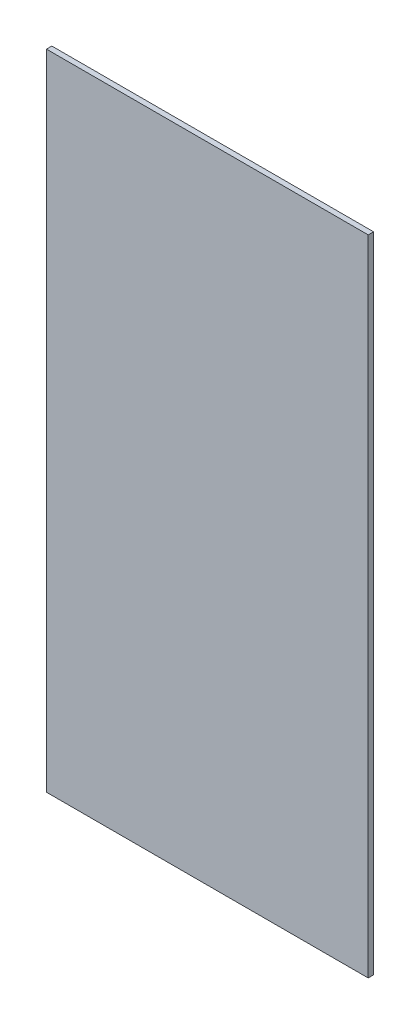
ISO-10303-21;
HEADER;
FILE_DESCRIPTION(('STEP AP214'),'2;1');
FILE_NAME('part.step','',(''),(''),'','','');
FILE_SCHEMA(('AUTOMOTIVE_DESIGN { 1 0 10303 214 1 1 1 1 }'));
ENDSEC;
DATA;
#1=APPLICATION_CONTEXT('core data for automotive mechanical design processes');
#2=APPLICATION_PROTOCOL_DEFINITION('international standard','automotive_design',2000,#1);
#3=PRODUCT_CONTEXT('',#1,'mechanical');
#4=PRODUCT('Part','Part','',(#3));
#5=PRODUCT_RELATED_PRODUCT_CATEGORY('part','',(#4));
#6=PRODUCT_DEFINITION_FORMATION('','',#4);
#7=PRODUCT_DEFINITION_CONTEXT('part definition',#1,'design');
#8=PRODUCT_DEFINITION('design','',#6,#7);
#9=PRODUCT_DEFINITION_SHAPE('','',#8);
#10=(LENGTH_UNIT() NAMED_UNIT(*) SI_UNIT(.MILLI.,.METRE.));
#11=(NAMED_UNIT(*) PLANE_ANGLE_UNIT() SI_UNIT($,.RADIAN.));
#12=(NAMED_UNIT(*) SI_UNIT($,.STERADIAN.) SOLID_ANGLE_UNIT());
#13=UNCERTAINTY_MEASURE_WITH_UNIT(LENGTH_MEASURE(1.E-05),#10,'distance_accuracy_value','');
#14=(GEOMETRIC_REPRESENTATION_CONTEXT(3) GLOBAL_UNCERTAINTY_ASSIGNED_CONTEXT((#13)) GLOBAL_UNIT_ASSIGNED_CONTEXT((#10,
#11,#12)) REPRESENTATION_CONTEXT('',''));
#15=CARTESIAN_POINT('',(0.,0.,0.));
#16=DIRECTION('',(0.,0.,1.));
#17=DIRECTION('',(1.,0.,0.));
#18=AXIS2_PLACEMENT_3D('',#15,#16,#17);
#19=CARTESIAN_POINT('',(-76.2,152.4,1.27));
#20=DIRECTION('',(1.,0.,0.));
#21=DIRECTION('',(0.,0.,-1.));
#22=AXIS2_PLACEMENT_3D('',#19,#20,#21);
#23=PLANE('',#22);
#24=DIRECTION('',(0.,-1.,0.));
#25=VECTOR('',#24,1.);
#26=CARTESIAN_POINT('',(-76.2,152.4,-1.27));
#27=LINE('',#26,#25);
#28=CARTESIAN_POINT('',(-76.2,152.4,-1.27));
#29=VERTEX_POINT('',#28);
#30=CARTESIAN_POINT('',(-76.2,-152.4,-1.27));
#31=VERTEX_POINT('',#30);
#32=EDGE_CURVE('E95',#29,#31,#27,.T.);
#33=ORIENTED_EDGE('',*,*,#32,.T.);
#34=DIRECTION('',(0.,0.,-1.));
#35=VECTOR('',#34,1.);
#36=CARTESIAN_POINT('',(-76.2,-152.4,1.27));
#37=LINE('',#36,#35);
#38=CARTESIAN_POINT('',(-76.2,-152.4,1.27));
#39=VERTEX_POINT('',#38);
#40=EDGE_CURVE('E11',#39,#31,#37,.T.);
#41=ORIENTED_EDGE('',*,*,#40,.F.);
#42=DIRECTION('',(0.,-1.,0.));
#43=VECTOR('',#42,1.);
#44=CARTESIAN_POINT('',(-76.2,152.4,1.27));
#45=LINE('',#44,#43);
#46=CARTESIAN_POINT('',(-76.2,152.4,1.27));
#47=VERTEX_POINT('',#46);
#48=EDGE_CURVE('E83',#47,#39,#45,.T.);
#49=ORIENTED_EDGE('',*,*,#48,.F.);
#50=DIRECTION('',(0.,0.,-1.));
#51=VECTOR('',#50,1.);
#52=CARTESIAN_POINT('',(-76.2,152.4,1.27));
#53=LINE('',#52,#51);
#54=EDGE_CURVE('E91',#47,#29,#53,.T.);
#55=ORIENTED_EDGE('',*,*,#54,.T.);
#56=EDGE_LOOP('',(#33,#41,#49,#55));
#57=FACE_BOUND('',#56,.T.);
#58=ADVANCED_FACE('F32',(#57),#23,.F.);
#59=CARTESIAN_POINT('',(-76.2,-152.4,1.27));
#60=DIRECTION('',(0.,1.,0.));
#61=DIRECTION('',(0.,0.,1.));
#62=AXIS2_PLACEMENT_3D('',#59,#60,#61);
#63=PLANE('',#62);
#64=DIRECTION('',(1.,0.,0.));
#65=VECTOR('',#64,1.);
#66=CARTESIAN_POINT('',(-76.2,-152.4,-1.27));
#67=LINE('',#66,#65);
#68=CARTESIAN_POINT('',(76.2,-152.4,-1.27));
#69=VERTEX_POINT('',#68);
#70=EDGE_CURVE('E87',#31,#69,#67,.T.);
#71=ORIENTED_EDGE('',*,*,#70,.T.);
#72=DIRECTION('',(0.,0.,-1.));
#73=VECTOR('',#72,1.);
#74=CARTESIAN_POINT('',(76.2,-152.4,1.27));
#75=LINE('',#74,#73);
#76=CARTESIAN_POINT('',(76.2,-152.4,1.27));
#77=VERTEX_POINT('',#76);
#78=EDGE_CURVE('E40',#77,#69,#75,.T.);
#79=ORIENTED_EDGE('',*,*,#78,.F.);
#80=DIRECTION('',(1.,0.,0.));
#81=VECTOR('',#80,1.);
#82=CARTESIAN_POINT('',(-76.2,-152.4,1.27));
#83=LINE('',#82,#81);
#84=EDGE_CURVE('E78',#39,#77,#83,.T.);
#85=ORIENTED_EDGE('',*,*,#84,.F.);
#86=ORIENTED_EDGE('',*,*,#40,.T.);
#87=EDGE_LOOP('',(#71,#79,#85,#86));
#88=FACE_BOUND('',#87,.T.);
#89=ADVANCED_FACE('F86',(#88),#63,.F.);
#90=CARTESIAN_POINT('',(76.2,152.4,1.27));
#91=DIRECTION('',(-1.,0.,0.));
#92=DIRECTION('',(0.,0.,1.));
#93=AXIS2_PLACEMENT_3D('',#90,#91,#92);
#94=PLANE('',#93);
#95=DIRECTION('',(0.,1.,0.));
#96=VECTOR('',#95,1.);
#97=CARTESIAN_POINT('',(76.2,152.4,-1.27));
#98=LINE('',#97,#96);
#99=CARTESIAN_POINT('',(76.2,152.4,-1.27));
#100=VERTEX_POINT('',#99);
#101=EDGE_CURVE('E65',#69,#100,#98,.T.);
#102=ORIENTED_EDGE('',*,*,#101,.T.);
#103=DIRECTION('',(0.,0.,-1.));
#104=VECTOR('',#103,1.);
#105=CARTESIAN_POINT('',(76.2,152.4,1.27));
#106=LINE('',#105,#104);
#107=CARTESIAN_POINT('',(76.2,152.4,1.27));
#108=VERTEX_POINT('',#107);
#109=EDGE_CURVE('E88',#108,#100,#106,.T.);
#110=ORIENTED_EDGE('',*,*,#109,.F.);
#111=DIRECTION('',(0.,1.,0.));
#112=VECTOR('',#111,1.);
#113=CARTESIAN_POINT('',(76.2,152.4,1.27));
#114=LINE('',#113,#112);
#115=EDGE_CURVE('E81',#77,#108,#114,.T.);
#116=ORIENTED_EDGE('',*,*,#115,.F.);
#117=ORIENTED_EDGE('',*,*,#78,.T.);
#118=EDGE_LOOP('',(#102,#110,#116,#117));
#119=FACE_BOUND('',#118,.T.);
#120=ADVANCED_FACE('F89',(#119),#94,.F.);
#121=CARTESIAN_POINT('',(-76.2,152.4,1.27));
#122=DIRECTION('',(0.,-1.,0.));
#123=DIRECTION('',(0.,0.,-1.));
#124=AXIS2_PLACEMENT_3D('',#121,#122,#123);
#125=PLANE('',#124);
#126=DIRECTION('',(-1.,0.,0.));
#127=VECTOR('',#126,1.);
#128=CARTESIAN_POINT('',(-76.2,152.4,-1.27));
#129=LINE('',#128,#127);
#130=EDGE_CURVE('E71',#100,#29,#129,.T.);
#131=ORIENTED_EDGE('',*,*,#130,.T.);
#132=ORIENTED_EDGE('',*,*,#54,.F.);
#133=DIRECTION('',(-1.,0.,0.));
#134=VECTOR('',#133,1.);
#135=CARTESIAN_POINT('',(-76.2,152.4,1.27));
#136=LINE('',#135,#134);
#137=EDGE_CURVE('E48',#108,#47,#136,.T.);
#138=ORIENTED_EDGE('',*,*,#137,.F.);
#139=ORIENTED_EDGE('',*,*,#109,.T.);
#140=EDGE_LOOP('',(#131,#132,#138,#139));
#141=FACE_BOUND('',#140,.T.);
#142=ADVANCED_FACE('F102',(#141),#125,.F.);
#143=CARTESIAN_POINT('',(0.,0.,1.27));
#144=DIRECTION('',(0.,0.,1.));
#145=DIRECTION('',(1.,0.,0.));
#146=AXIS2_PLACEMENT_3D('',#143,#144,#145);
#147=PLANE('',#146);
#148=ORIENTED_EDGE('',*,*,#48,.T.);
#149=ORIENTED_EDGE('',*,*,#84,.T.);
#150=ORIENTED_EDGE('',*,*,#115,.T.);
#151=ORIENTED_EDGE('',*,*,#137,.T.);
#152=EDGE_LOOP('',(#148,#149,#150,#151));
#153=FACE_BOUND('',#152,.T.);
#154=ADVANCED_FACE('F79',(#153),#147,.T.);
#155=CARTESIAN_POINT('',(0.,0.,-1.27));
#156=DIRECTION('',(0.,0.,1.));
#157=DIRECTION('',(1.,0.,0.));
#158=AXIS2_PLACEMENT_3D('',#155,#156,#157);
#159=PLANE('',#158);
#160=ORIENTED_EDGE('',*,*,#32,.F.);
#161=ORIENTED_EDGE('',*,*,#130,.F.);
#162=ORIENTED_EDGE('',*,*,#101,.F.);
#163=ORIENTED_EDGE('',*,*,#70,.F.);
#164=EDGE_LOOP('',(#160,#161,#162,#163));
#165=FACE_BOUND('',#164,.T.);
#166=ADVANCED_FACE('F105',(#165),#159,.F.);
#167=CLOSED_SHELL('',(#58,#89,#120,#142,#154,#166));
#168=MANIFOLD_SOLID_BREP('B2',#167);
#169=ADVANCED_BREP_SHAPE_REPRESENTATION('',(#18,#168),#14);
#170=SHAPE_DEFINITION_REPRESENTATION(#9,#169);
ENDSEC;
END-ISO-10303-21;
